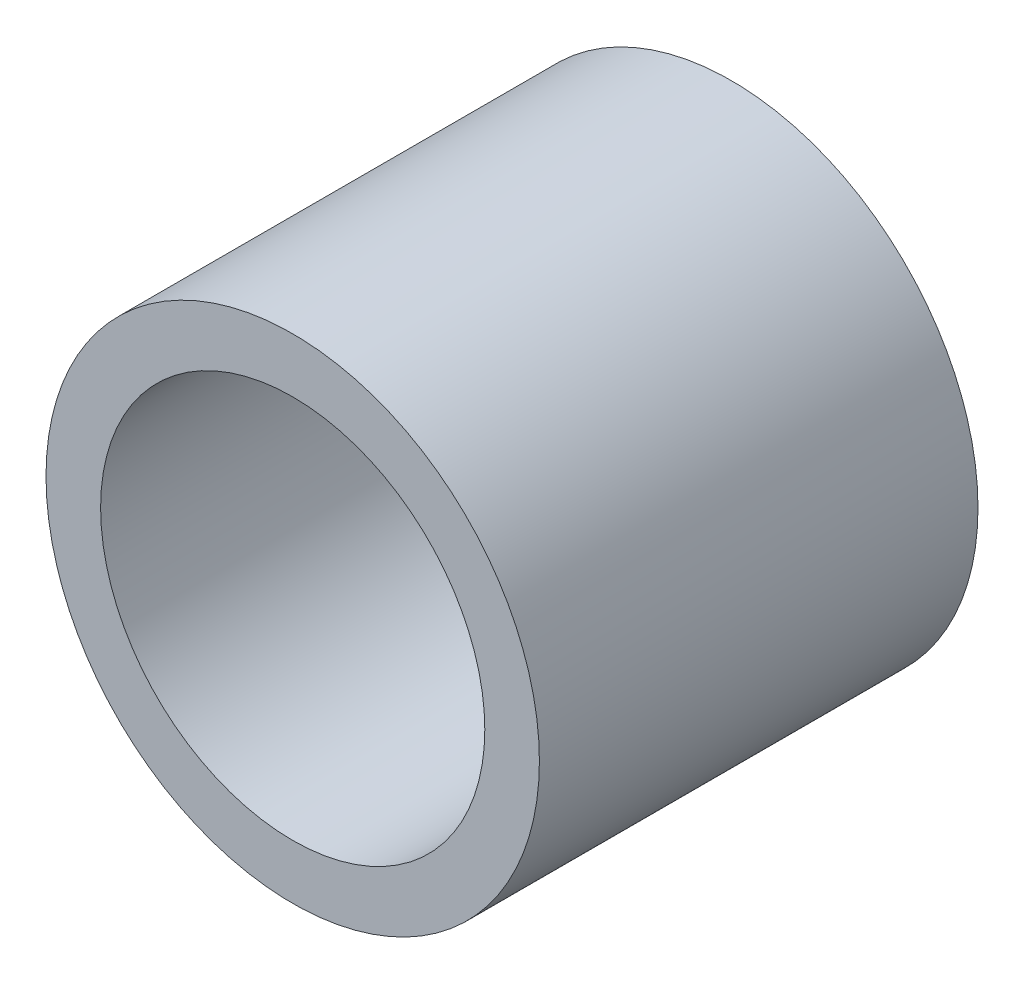
ISO-10303-21;
HEADER;
FILE_DESCRIPTION(('STEP AP214'),'2;1');
FILE_NAME('part.step','',(''),(''),'','','');
FILE_SCHEMA(('AUTOMOTIVE_DESIGN { 1 0 10303 214 1 1 1 1 }'));
ENDSEC;
DATA;
#1=APPLICATION_CONTEXT('core data for automotive mechanical design processes');
#2=APPLICATION_PROTOCOL_DEFINITION('international standard','automotive_design',2000,#1);
#3=PRODUCT_CONTEXT('',#1,'mechanical');
#4=PRODUCT('Part','Part','',(#3));
#5=PRODUCT_RELATED_PRODUCT_CATEGORY('part','',(#4));
#6=PRODUCT_DEFINITION_FORMATION('','',#4);
#7=PRODUCT_DEFINITION_CONTEXT('part definition',#1,'design');
#8=PRODUCT_DEFINITION('design','',#6,#7);
#9=PRODUCT_DEFINITION_SHAPE('','',#8);
#10=(LENGTH_UNIT() NAMED_UNIT(*) SI_UNIT(.MILLI.,.METRE.));
#11=(NAMED_UNIT(*) PLANE_ANGLE_UNIT() SI_UNIT($,.RADIAN.));
#12=(NAMED_UNIT(*) SI_UNIT($,.STERADIAN.) SOLID_ANGLE_UNIT());
#13=UNCERTAINTY_MEASURE_WITH_UNIT(LENGTH_MEASURE(1.E-05),#10,'distance_accuracy_value','');
#14=(GEOMETRIC_REPRESENTATION_CONTEXT(3) GLOBAL_UNCERTAINTY_ASSIGNED_CONTEXT((#13)) GLOBAL_UNIT_ASSIGNED_CONTEXT((#10,
#11,#12)) REPRESENTATION_CONTEXT('',''));
#15=CARTESIAN_POINT('',(0.,0.,0.));
#16=DIRECTION('',(0.,0.,1.));
#17=DIRECTION('',(1.,0.,0.));
#18=AXIS2_PLACEMENT_3D('',#15,#16,#17);
#19=CARTESIAN_POINT('',(0.,0.,12.7));
#20=DIRECTION('',(0.,0.,1.));
#21=DIRECTION('',(1.,0.,0.));
#22=AXIS2_PLACEMENT_3D('',#19,#20,#21);
#23=PLANE('',#22);
#24=CARTESIAN_POINT('',(0.,0.,12.7));
#25=DIRECTION('',(0.,0.,1.));
#26=DIRECTION('',(1.,0.,0.));
#27=AXIS2_PLACEMENT_3D('',#24,#25,#26);
#28=CIRCLE('',#27,14.2875);
#29=CARTESIAN_POINT('',(14.2875,0.,12.7));
#30=VERTEX_POINT('',#29);
#31=EDGE_CURVE('E10',#30,#30,#28,.T.);
#32=ORIENTED_EDGE('',*,*,#31,.T.);
#33=EDGE_LOOP('',(#32));
#34=FACE_BOUND('',#33,.T.);
#35=CARTESIAN_POINT('',(0.,0.,12.7));
#36=DIRECTION('',(0.,0.,1.));
#37=DIRECTION('',(1.,0.,0.));
#38=AXIS2_PLACEMENT_3D('',#35,#36,#37);
#39=CIRCLE('',#38,11.1252);
#40=CARTESIAN_POINT('',(11.1252,0.,12.7));
#41=VERTEX_POINT('',#40);
#42=EDGE_CURVE('E41',#41,#41,#39,.T.);
#43=ORIENTED_EDGE('',*,*,#42,.F.);
#44=EDGE_LOOP('',(#43));
#45=FACE_BOUND('',#44,.T.);
#46=ADVANCED_FACE('F30',(#34,#45),#23,.T.);
#47=CARTESIAN_POINT('',(0.,0.,-12.7));
#48=DIRECTION('',(0.,0.,1.));
#49=DIRECTION('',(1.,0.,0.));
#50=AXIS2_PLACEMENT_3D('',#47,#48,#49);
#51=PLANE('',#50);
#52=CARTESIAN_POINT('',(0.,0.,-12.7));
#53=DIRECTION('',(0.,0.,1.));
#54=DIRECTION('',(1.,0.,0.));
#55=AXIS2_PLACEMENT_3D('',#52,#53,#54);
#56=CIRCLE('',#55,14.2875);
#57=CARTESIAN_POINT('',(14.2875,0.,-12.7));
#58=VERTEX_POINT('',#57);
#59=EDGE_CURVE('E34',#58,#58,#56,.T.);
#60=ORIENTED_EDGE('',*,*,#59,.F.);
#61=EDGE_LOOP('',(#60));
#62=FACE_BOUND('',#61,.T.);
#63=CARTESIAN_POINT('',(0.,0.,-12.7));
#64=DIRECTION('',(0.,0.,1.));
#65=DIRECTION('',(1.,0.,0.));
#66=AXIS2_PLACEMENT_3D('',#63,#64,#65);
#67=CIRCLE('',#66,11.1252);
#68=CARTESIAN_POINT('',(11.1252,0.,-12.7));
#69=VERTEX_POINT('',#68);
#70=EDGE_CURVE('E43',#69,#69,#67,.T.);
#71=ORIENTED_EDGE('',*,*,#70,.T.);
#72=EDGE_LOOP('',(#71));
#73=FACE_BOUND('',#72,.T.);
#74=ADVANCED_FACE('F53',(#62,#73),#51,.F.);
#75=CARTESIAN_POINT('',(0.,0.,12.7));
#76=DIRECTION('',(0.,0.,-1.));
#77=DIRECTION('',(-1.,0.,0.));
#78=AXIS2_PLACEMENT_3D('',#75,#76,#77);
#79=CYLINDRICAL_SURFACE('',#78,14.2875);
#80=ORIENTED_EDGE('',*,*,#31,.F.);
#81=EDGE_LOOP('',(#80));
#82=FACE_BOUND('',#81,.T.);
#83=ORIENTED_EDGE('',*,*,#59,.T.);
#84=EDGE_LOOP('',(#83));
#85=FACE_BOUND('',#84,.T.);
#86=ADVANCED_FACE('F32',(#82,#85),#79,.T.);
#87=CARTESIAN_POINT('',(0.,0.,12.7));
#88=DIRECTION('',(0.,0.,-1.));
#89=DIRECTION('',(-1.,0.,0.));
#90=AXIS2_PLACEMENT_3D('',#87,#88,#89);
#91=CYLINDRICAL_SURFACE('',#90,11.1252);
#92=ORIENTED_EDGE('',*,*,#42,.T.);
#93=EDGE_LOOP('',(#92));
#94=FACE_BOUND('',#93,.T.);
#95=ORIENTED_EDGE('',*,*,#70,.F.);
#96=EDGE_LOOP('',(#95));
#97=FACE_BOUND('',#96,.T.);
#98=ADVANCED_FACE('F49',(#94,#97),#91,.F.);
#99=CLOSED_SHELL('',(#46,#74,#86,#98));
#100=MANIFOLD_SOLID_BREP('B2',#99);
#101=ADVANCED_BREP_SHAPE_REPRESENTATION('',(#18,#100),#14);
#102=SHAPE_DEFINITION_REPRESENTATION(#9,#101);
ENDSEC;
END-ISO-10303-21;
